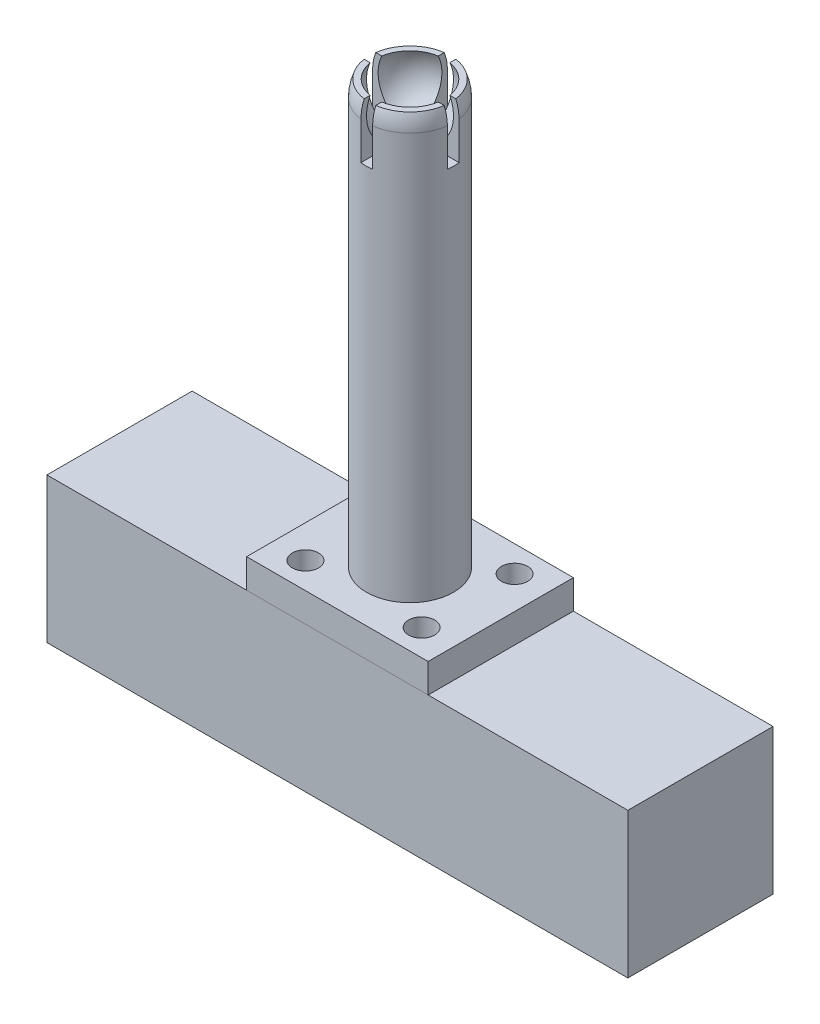
ISO-10303-21;
HEADER;
FILE_DESCRIPTION(('STEP AP214'),'2;1');
FILE_NAME('part.step','',(''),(''),'','','');
FILE_SCHEMA(('AUTOMOTIVE_DESIGN { 1 0 10303 214 1 1 1 1 }'));
ENDSEC;
DATA;
#1=APPLICATION_CONTEXT('core data for automotive mechanical design processes');
#2=APPLICATION_PROTOCOL_DEFINITION('international standard','automotive_design',2000,#1);
#3=PRODUCT_CONTEXT('',#1,'mechanical');
#4=PRODUCT('Part','Part','',(#3));
#5=PRODUCT_RELATED_PRODUCT_CATEGORY('part','',(#4));
#6=PRODUCT_DEFINITION_FORMATION('','',#4);
#7=PRODUCT_DEFINITION_CONTEXT('part definition',#1,'design');
#8=PRODUCT_DEFINITION('design','',#6,#7);
#9=PRODUCT_DEFINITION_SHAPE('','',#8);
#10=(LENGTH_UNIT() NAMED_UNIT(*) SI_UNIT(.MILLI.,.METRE.));
#11=(NAMED_UNIT(*) PLANE_ANGLE_UNIT() SI_UNIT($,.RADIAN.));
#12=(NAMED_UNIT(*) SI_UNIT($,.STERADIAN.) SOLID_ANGLE_UNIT());
#13=UNCERTAINTY_MEASURE_WITH_UNIT(LENGTH_MEASURE(1.E-05),#10,'distance_accuracy_value','');
#14=(GEOMETRIC_REPRESENTATION_CONTEXT(3) GLOBAL_UNCERTAINTY_ASSIGNED_CONTEXT((#13)) GLOBAL_UNIT_ASSIGNED_CONTEXT((#10,
#11,#12)) REPRESENTATION_CONTEXT('',''));
#15=CARTESIAN_POINT('',(0.,0.,0.));
#16=DIRECTION('',(0.,0.,1.));
#17=DIRECTION('',(1.,0.,0.));
#18=AXIS2_PLACEMENT_3D('',#15,#16,#17);
#19=CARTESIAN_POINT('',(0.,93.98,0.));
#20=DIRECTION('',(0.,-1.,0.));
#21=DIRECTION('',(0.,0.,-1.));
#22=AXIS2_PLACEMENT_3D('',#19,#20,#21);
#23=CYLINDRICAL_SURFACE('',#22,7.62);
#24=CARTESIAN_POINT('',(0.,30.48,0.));
#25=DIRECTION('',(0.,1.,0.));
#26=DIRECTION('',(0.,0.,1.));
#27=AXIS2_PLACEMENT_3D('',#24,#25,#26);
#28=CIRCLE('',#27,7.62);
#29=CARTESIAN_POINT('',(0.,30.48,7.62));
#30=VERTEX_POINT('',#29);
#31=EDGE_CURVE('E346',#30,#30,#28,.T.);
#32=ORIENTED_EDGE('',*,*,#31,.T.);
#33=EDGE_LOOP('',(#32));
#34=FACE_BOUND('',#33,.T.);
#35=CARTESIAN_POINT('',(0.,101.6,0.));
#36=DIRECTION('',(0.,1.,0.));
#37=DIRECTION('',(0.,0.,1.));
#38=AXIS2_PLACEMENT_3D('',#35,#36,#37);
#39=CIRCLE('',#38,7.62);
#40=CARTESIAN_POINT('',(7.5519629236378,101.6,-1.016));
#41=VERTEX_POINT('',#40);
#42=CARTESIAN_POINT('',(1.016,101.6,-7.5519629236378));
#43=VERTEX_POINT('',#42);
#44=EDGE_CURVE('E336',#41,#43,#39,.T.);
#45=ORIENTED_EDGE('',*,*,#44,.F.);
#46=DIRECTION('',(0.,-1.,0.));
#47=VECTOR('',#46,1.);
#48=CARTESIAN_POINT('',(7.5519629236378,93.98,-1.016));
#49=LINE('',#48,#47);
#50=CARTESIAN_POINT('',(7.5519629236378,95.0198072601561,-1.016));
#51=VERTEX_POINT('',#50);
#52=EDGE_CURVE('E294',#41,#51,#49,.T.);
#53=ORIENTED_EDGE('',*,*,#52,.T.);
#54=CARTESIAN_POINT('',(0.,95.0198072601561,0.));
#55=DIRECTION('',(0.,1.,0.));
#56=DIRECTION('',(0.,0.,1.));
#57=AXIS2_PLACEMENT_3D('',#54,#55,#56);
#58=CIRCLE('',#57,7.62);
#59=CARTESIAN_POINT('',(7.5519629236378,95.0198072601561,1.016));
#60=VERTEX_POINT('',#59);
#61=EDGE_CURVE('E331',#60,#51,#58,.T.);
#62=ORIENTED_EDGE('',*,*,#61,.F.);
#63=DIRECTION('',(0.,-1.,0.));
#64=VECTOR('',#63,1.);
#65=CARTESIAN_POINT('',(7.5519629236378,93.98,1.016));
#66=LINE('',#65,#64);
#67=CARTESIAN_POINT('',(7.5519629236378,101.6,1.016));
#68=VERTEX_POINT('',#67);
#69=EDGE_CURVE('E230',#68,#60,#66,.T.);
#70=ORIENTED_EDGE('',*,*,#69,.F.);
#71=CARTESIAN_POINT('',(1.01600000000001,101.6,7.5519629236378));
#72=VERTEX_POINT('',#71);
#73=EDGE_CURVE('E332',#72,#68,#39,.T.);
#74=ORIENTED_EDGE('',*,*,#73,.F.);
#75=DIRECTION('',(0.,-1.,0.));
#76=VECTOR('',#75,1.);
#77=CARTESIAN_POINT('',(1.01600000000001,93.98,7.5519629236378));
#78=LINE('',#77,#76);
#79=CARTESIAN_POINT('',(1.01600000000001,95.0198072601561,7.5519629236378));
#80=VERTEX_POINT('',#79);
#81=EDGE_CURVE('E326',#80,#72,#78,.F.);
#82=ORIENTED_EDGE('',*,*,#81,.F.);
#83=CARTESIAN_POINT('',(-1.01599999999999,95.0198072601561,7.5519629236378));
#84=VERTEX_POINT('',#83);
#85=EDGE_CURVE('E249',#84,#80,#58,.T.);
#86=ORIENTED_EDGE('',*,*,#85,.F.);
#87=DIRECTION('',(0.,-1.,0.));
#88=VECTOR('',#87,1.);
#89=CARTESIAN_POINT('',(-1.01599999999999,93.98,7.5519629236378));
#90=LINE('',#89,#88);
#91=CARTESIAN_POINT('',(-1.01599999999999,101.6,7.5519629236378));
#92=VERTEX_POINT('',#91);
#93=EDGE_CURVE('E320',#84,#92,#90,.F.);
#94=ORIENTED_EDGE('',*,*,#93,.T.);
#95=CARTESIAN_POINT('',(-7.5519629236378,101.6,1.016));
#96=VERTEX_POINT('',#95);
#97=EDGE_CURVE('E337',#96,#92,#39,.T.);
#98=ORIENTED_EDGE('',*,*,#97,.F.);
#99=DIRECTION('',(0.,-1.,0.));
#100=VECTOR('',#99,1.);
#101=CARTESIAN_POINT('',(-7.5519629236378,93.98,1.016));
#102=LINE('',#101,#100);
#103=CARTESIAN_POINT('',(-7.5519629236378,95.0198072601561,1.016));
#104=VERTEX_POINT('',#103);
#105=EDGE_CURVE('E316',#104,#96,#102,.F.);
#106=ORIENTED_EDGE('',*,*,#105,.F.);
#107=CARTESIAN_POINT('',(-7.5519629236378,95.0198072601561,-1.016));
#108=VERTEX_POINT('',#107);
#109=EDGE_CURVE('E330',#108,#104,#58,.T.);
#110=ORIENTED_EDGE('',*,*,#109,.F.);
#111=DIRECTION('',(0.,-1.,0.));
#112=VECTOR('',#111,1.);
#113=CARTESIAN_POINT('',(-7.5519629236378,93.98,-1.016));
#114=LINE('',#113,#112);
#115=CARTESIAN_POINT('',(-7.5519629236378,101.6,-1.016));
#116=VERTEX_POINT('',#115);
#117=EDGE_CURVE('E310',#108,#116,#114,.F.);
#118=ORIENTED_EDGE('',*,*,#117,.T.);
#119=CARTESIAN_POINT('',(-1.016,101.6,-7.5519629236378));
#120=VERTEX_POINT('',#119);
#121=EDGE_CURVE('E425',#120,#116,#39,.T.);
#122=ORIENTED_EDGE('',*,*,#121,.F.);
#123=DIRECTION('',(0.,-1.,0.));
#124=VECTOR('',#123,1.);
#125=CARTESIAN_POINT('',(-1.016,93.98,-7.5519629236378));
#126=LINE('',#125,#124);
#127=CARTESIAN_POINT('',(-1.016,95.0198072601561,-7.5519629236378));
#128=VERTEX_POINT('',#127);
#129=EDGE_CURVE('E304',#120,#128,#126,.T.);
#130=ORIENTED_EDGE('',*,*,#129,.T.);
#131=CARTESIAN_POINT('',(1.016,95.0198072601561,-7.5519629236378));
#132=VERTEX_POINT('',#131);
#133=EDGE_CURVE('E427',#132,#128,#58,.T.);
#134=ORIENTED_EDGE('',*,*,#133,.F.);
#135=DIRECTION('',(0.,-1.,0.));
#136=VECTOR('',#135,1.);
#137=CARTESIAN_POINT('',(1.016,93.98,-7.5519629236378));
#138=LINE('',#137,#136);
#139=EDGE_CURVE('E300',#43,#132,#138,.T.);
#140=ORIENTED_EDGE('',*,*,#139,.F.);
#141=EDGE_LOOP('',(#45,#53,#62,#70,#74,#82,#86,#94,#98,#106,#110,#118,#122,#130,#134,#140));
#142=FACE_BOUND('',#141,.T.);
#143=ADVANCED_FACE('F53',(#34,#142),#23,.T.);
#144=CARTESIAN_POINT('',(0.,101.6,0.));
#145=DIRECTION('',(0.,1.,0.));
#146=DIRECTION('',(-1.,0.,0.));
#147=AXIS2_PLACEMENT_3D('',#144,#145,#146);
#148=SPHERICAL_SURFACE('',#147,6.6675);
#149=CARTESIAN_POINT('',(0.,104.417807260156,0.));
#150=DIRECTION('',(0.,1.,0.));
#151=DIRECTION('',(0.,0.,1.));
#152=AXIS2_PLACEMENT_3D('',#149,#150,#151);
#153=CIRCLE('',#152,6.04280717006687);
#154=CARTESIAN_POINT('',(-5.95678289805929,104.417807260156,1.016));
#155=VERTEX_POINT('',#154);
#156=CARTESIAN_POINT('',(-1.01599999999999,104.417807260156,5.95678289805929));
#157=VERTEX_POINT('',#156);
#158=EDGE_CURVE('E341',#155,#157,#153,.T.);
#159=ORIENTED_EDGE('',*,*,#158,.T.);
#160=CARTESIAN_POINT('',(-1.01599999999999,101.6,0.));
#161=DIRECTION('',(-1.,0.,0.));
#162=DIRECTION('',(0.,0.,1.));
#163=AXIS2_PLACEMENT_3D('',#160,#161,#162);
#164=CIRCLE('',#163,6.58963582074154);
#165=CARTESIAN_POINT('',(-1.01599999999999,95.0891594820638,1.016));
#166=VERTEX_POINT('',#165);
#167=EDGE_CURVE('E323',#157,#166,#164,.F.);
#168=ORIENTED_EDGE('',*,*,#167,.T.);
#169=CARTESIAN_POINT('',(0.,101.6,1.016));
#170=DIRECTION('',(0.,0.,-1.));
#171=DIRECTION('',(-1.,0.,0.));
#172=AXIS2_PLACEMENT_3D('',#169,#170,#171);
#173=CIRCLE('',#172,6.58963582074154);
#174=EDGE_CURVE('E318',#155,#166,#173,.F.);
#175=ORIENTED_EDGE('',*,*,#174,.F.);
#176=EDGE_LOOP('',(#159,#168,#175));
#177=FACE_BOUND('',#176,.T.);
#178=ADVANCED_FACE('F440',(#177),#148,.F.);
#179=CARTESIAN_POINT('',(1.01600000000001,101.6,0.));
#180=DIRECTION('',(-1.,0.,0.));
#181=DIRECTION('',(0.,0.,1.));
#182=AXIS2_PLACEMENT_3D('',#179,#180,#181);
#183=CIRCLE('',#182,6.58963582074154);
#184=CARTESIAN_POINT('',(1.01600000000001,95.0891594820638,-1.016));
#185=VERTEX_POINT('',#184);
#186=CARTESIAN_POINT('',(1.016,104.417807260156,-5.95678289805929));
#187=VERTEX_POINT('',#186);
#188=EDGE_CURVE('E302',#185,#187,#183,.F.);
#189=ORIENTED_EDGE('',*,*,#188,.F.);
#190=CARTESIAN_POINT('',(0.,101.6,-1.016));
#191=DIRECTION('',(0.,0.,-1.));
#192=DIRECTION('',(-1.,0.,0.));
#193=AXIS2_PLACEMENT_3D('',#190,#191,#192);
#194=CIRCLE('',#193,6.58963582074154);
#195=CARTESIAN_POINT('',(5.95678289805929,104.417807260156,-1.016));
#196=VERTEX_POINT('',#195);
#197=EDGE_CURVE('E297',#185,#196,#194,.F.);
#198=ORIENTED_EDGE('',*,*,#197,.T.);
#199=EDGE_CURVE('E347',#196,#187,#153,.T.);
#200=ORIENTED_EDGE('',*,*,#199,.T.);
#201=EDGE_LOOP('',(#189,#198,#200));
#202=FACE_BOUND('',#201,.T.);
#203=ADVANCED_FACE('F451',(#202),#148,.F.);
#204=CARTESIAN_POINT('',(1.01600000000001,101.6,0.));
#205=DIRECTION('',(-1.,0.,0.));
#206=DIRECTION('',(0.,0.,1.));
#207=AXIS2_PLACEMENT_3D('',#204,#205,#206);
#208=CIRCLE('',#207,6.58963582074154);
#209=CARTESIAN_POINT('',(1.01600000000001,104.417807260156,5.95678289805929));
#210=VERTEX_POINT('',#209);
#211=CARTESIAN_POINT('',(1.01600000000001,95.0891594820638,1.016));
#212=VERTEX_POINT('',#211);
#213=EDGE_CURVE('E242',#210,#212,#208,.F.);
#214=ORIENTED_EDGE('',*,*,#213,.F.);
#215=CARTESIAN_POINT('',(5.95678289805929,104.417807260156,1.016));
#216=VERTEX_POINT('',#215);
#217=EDGE_CURVE('E343',#210,#216,#153,.T.);
#218=ORIENTED_EDGE('',*,*,#217,.T.);
#219=CARTESIAN_POINT('',(0.,101.6,1.016));
#220=DIRECTION('',(0.,0.,-1.));
#221=DIRECTION('',(-1.,0.,0.));
#222=AXIS2_PLACEMENT_3D('',#219,#220,#221);
#223=CIRCLE('',#222,6.58963582074154);
#224=EDGE_CURVE('E292',#212,#216,#223,.F.);
#225=ORIENTED_EDGE('',*,*,#224,.F.);
#226=EDGE_LOOP('',(#214,#218,#225));
#227=FACE_BOUND('',#226,.T.);
#228=ADVANCED_FACE('F595',(#227),#148,.F.);
#229=CARTESIAN_POINT('',(-2.79463802660951E-12,104.417807260156,0.));
#230=DIRECTION('',(0.,1.,0.));
#231=DIRECTION('',(0.,0.,1.));
#232=AXIS2_PLACEMENT_3D('',#229,#230,#231);
#233=PLANE('',#232);
#234=ORIENTED_EDGE('',*,*,#217,.F.);
#235=DIRECTION('',(0.,0.,1.));
#236=VECTOR('',#235,1.);
#237=CARTESIAN_POINT('',(1.01600000000001,104.417807260156,0.));
#238=LINE('',#237,#236);
#239=CARTESIAN_POINT('',(1.01600000000001,104.417807260156,7.0065759286981));
#240=VERTEX_POINT('',#239);
#241=EDGE_CURVE('E268',#210,#240,#238,.T.);
#242=ORIENTED_EDGE('',*,*,#241,.T.);
#243=CARTESIAN_POINT('',(0.,104.417807260156,0.));
#244=DIRECTION('',(0.,1.,0.));
#245=DIRECTION('',(0.,0.,1.));
#246=AXIS2_PLACEMENT_3D('',#243,#244,#245);
#247=CIRCLE('',#246,7.07985608925858);
#248=CARTESIAN_POINT('',(7.00657592869811,104.417807260156,1.016));
#249=VERTEX_POINT('',#248);
#250=EDGE_CURVE('E338',#240,#249,#247,.T.);
#251=ORIENTED_EDGE('',*,*,#250,.T.);
#252=DIRECTION('',(-1.,0.,0.));
#253=VECTOR('',#252,1.);
#254=CARTESIAN_POINT('',(0.,104.417807260156,1.016));
#255=LINE('',#254,#253);
#256=EDGE_CURVE('E69',#249,#216,#255,.T.);
#257=ORIENTED_EDGE('',*,*,#256,.T.);
#258=EDGE_LOOP('',(#234,#242,#251,#257));
#259=FACE_BOUND('',#258,.T.);
#260=ADVANCED_FACE('F589',(#259),#233,.T.);
#261=DIRECTION('',(0.,0.,1.));
#262=VECTOR('',#261,1.);
#263=CARTESIAN_POINT('',(-1.01599999999999,104.417807260156,0.));
#264=LINE('',#263,#262);
#265=CARTESIAN_POINT('',(-1.01599999999999,104.417807260156,7.0065759286981));
#266=VERTEX_POINT('',#265);
#267=EDGE_CURVE('E250',#157,#266,#264,.T.);
#268=ORIENTED_EDGE('',*,*,#267,.F.);
#269=ORIENTED_EDGE('',*,*,#158,.F.);
#270=DIRECTION('',(-1.,0.,0.));
#271=VECTOR('',#270,1.);
#272=CARTESIAN_POINT('',(0.,104.417807260156,1.016));
#273=LINE('',#272,#271);
#274=CARTESIAN_POINT('',(-7.0065759286981,104.417807260156,1.016));
#275=VERTEX_POINT('',#274);
#276=EDGE_CURVE('E252',#155,#275,#273,.T.);
#277=ORIENTED_EDGE('',*,*,#276,.T.);
#278=EDGE_CURVE('E335',#275,#266,#247,.T.);
#279=ORIENTED_EDGE('',*,*,#278,.T.);
#280=EDGE_LOOP('',(#268,#269,#277,#279));
#281=FACE_BOUND('',#280,.T.);
#282=ADVANCED_FACE('F582',(#281),#233,.T.);
#283=CARTESIAN_POINT('',(7.0065759286981,104.417807260156,-1.016));
#284=VERTEX_POINT('',#283);
#285=CARTESIAN_POINT('',(1.016,104.417807260156,-7.0065759286981));
#286=VERTEX_POINT('',#285);
#287=EDGE_CURVE('E342',#284,#286,#247,.T.);
#288=ORIENTED_EDGE('',*,*,#287,.T.);
#289=DIRECTION('',(0.,0.,1.));
#290=VECTOR('',#289,1.);
#291=CARTESIAN_POINT('',(1.01600000000001,104.417807260156,0.));
#292=LINE('',#291,#290);
#293=EDGE_CURVE('E274',#286,#187,#292,.T.);
#294=ORIENTED_EDGE('',*,*,#293,.T.);
#295=ORIENTED_EDGE('',*,*,#199,.F.);
#296=DIRECTION('',(-1.,0.,0.));
#297=VECTOR('',#296,1.);
#298=CARTESIAN_POINT('',(0.,104.417807260156,-1.016));
#299=LINE('',#298,#297);
#300=EDGE_CURVE('E272',#284,#196,#299,.T.);
#301=ORIENTED_EDGE('',*,*,#300,.F.);
#302=EDGE_LOOP('',(#288,#294,#295,#301));
#303=FACE_BOUND('',#302,.T.);
#304=ADVANCED_FACE('F455',(#303),#233,.T.);
#305=CARTESIAN_POINT('',(0.,101.6,0.));
#306=DIRECTION('',(0.,1.,0.));
#307=DIRECTION('',(-1.,0.,0.));
#308=AXIS2_PLACEMENT_3D('',#305,#306,#307);
#309=SPHERICAL_SURFACE('',#308,7.62);
#310=ORIENTED_EDGE('',*,*,#250,.F.);
#311=CARTESIAN_POINT('',(1.01600000000001,101.6,0.));
#312=DIRECTION('',(-1.,0.,0.));
#313=DIRECTION('',(0.,0.,1.));
#314=AXIS2_PLACEMENT_3D('',#311,#312,#313);
#315=CIRCLE('',#314,7.5519629236378);
#316=EDGE_CURVE('E12',#240,#72,#315,.F.);
#317=ORIENTED_EDGE('',*,*,#316,.T.);
#318=ORIENTED_EDGE('',*,*,#73,.T.);
#319=CARTESIAN_POINT('',(0.,101.6,1.016));
#320=DIRECTION('',(0.,0.,-1.));
#321=DIRECTION('',(-1.,0.,0.));
#322=AXIS2_PLACEMENT_3D('',#319,#320,#321);
#323=CIRCLE('',#322,7.5519629236378);
#324=EDGE_CURVE('E397',#68,#249,#323,.F.);
#325=ORIENTED_EDGE('',*,*,#324,.T.);
#326=EDGE_LOOP('',(#310,#317,#318,#325));
#327=FACE_BOUND('',#326,.T.);
#328=ADVANCED_FACE('F570',(#327),#309,.T.);
#329=CARTESIAN_POINT('',(-1.01599999999999,101.6,0.));
#330=DIRECTION('',(-1.,0.,0.));
#331=DIRECTION('',(0.,0.,1.));
#332=AXIS2_PLACEMENT_3D('',#329,#330,#331);
#333=CIRCLE('',#332,7.5519629236378);
#334=EDGE_CURVE('E62',#266,#92,#333,.F.);
#335=ORIENTED_EDGE('',*,*,#334,.F.);
#336=ORIENTED_EDGE('',*,*,#278,.F.);
#337=CARTESIAN_POINT('',(0.,101.6,1.016));
#338=DIRECTION('',(0.,0.,-1.));
#339=DIRECTION('',(-1.,0.,0.));
#340=AXIS2_PLACEMENT_3D('',#337,#338,#339);
#341=CIRCLE('',#340,7.5519629236378);
#342=EDGE_CURVE('E408',#275,#96,#341,.F.);
#343=ORIENTED_EDGE('',*,*,#342,.T.);
#344=ORIENTED_EDGE('',*,*,#97,.T.);
#345=EDGE_LOOP('',(#335,#336,#343,#344));
#346=FACE_BOUND('',#345,.T.);
#347=ADVANCED_FACE('F424',(#346),#309,.T.);
#348=ORIENTED_EDGE('',*,*,#44,.T.);
#349=CARTESIAN_POINT('',(1.01600000000001,101.6,0.));
#350=DIRECTION('',(-1.,0.,0.));
#351=DIRECTION('',(0.,0.,1.));
#352=AXIS2_PLACEMENT_3D('',#349,#350,#351);
#353=CIRCLE('',#352,7.5519629236378);
#354=EDGE_CURVE('E401',#43,#286,#353,.F.);
#355=ORIENTED_EDGE('',*,*,#354,.T.);
#356=ORIENTED_EDGE('',*,*,#287,.F.);
#357=CARTESIAN_POINT('',(0.,101.6,-1.016));
#358=DIRECTION('',(0.,0.,-1.));
#359=DIRECTION('',(-1.,0.,0.));
#360=AXIS2_PLACEMENT_3D('',#357,#358,#359);
#361=CIRCLE('',#360,7.5519629236378);
#362=EDGE_CURVE('E399',#41,#284,#361,.F.);
#363=ORIENTED_EDGE('',*,*,#362,.F.);
#364=EDGE_LOOP('',(#348,#355,#356,#363));
#365=FACE_BOUND('',#364,.T.);
#366=ADVANCED_FACE('F462',(#365),#309,.T.);
#367=CARTESIAN_POINT('',(0.,30.48,0.));
#368=DIRECTION('',(0.,1.,0.));
#369=DIRECTION('',(0.,0.,1.));
#370=AXIS2_PLACEMENT_3D('',#367,#368,#369);
#371=PLANE('',#370);
#372=ORIENTED_EDGE('',*,*,#31,.F.);
#373=EDGE_LOOP('',(#372));
#374=FACE_BOUND('',#373,.T.);
#375=CARTESIAN_POINT('',(-10.16,30.48,-8.12800000000001));
#376=DIRECTION('',(0.,1.,0.));
#377=DIRECTION('',(0.,0.,1.));
#378=AXIS2_PLACEMENT_3D('',#375,#376,#377);
#379=CIRCLE('',#378,2.286);
#380=CARTESIAN_POINT('',(-10.16,30.48,-5.84200000000001));
#381=VERTEX_POINT('',#380);
#382=EDGE_CURVE('E357',#381,#381,#379,.T.);
#383=ORIENTED_EDGE('',*,*,#382,.F.);
#384=EDGE_LOOP('',(#383));
#385=FACE_BOUND('',#384,.T.);
#386=CARTESIAN_POINT('',(10.16,30.48,8.12800000000001));
#387=DIRECTION('',(0.,1.,0.));
#388=DIRECTION('',(0.,0.,1.));
#389=AXIS2_PLACEMENT_3D('',#386,#387,#388);
#390=CIRCLE('',#389,2.286);
#391=CARTESIAN_POINT('',(10.16,30.48,10.414));
#392=VERTEX_POINT('',#391);
#393=EDGE_CURVE('E369',#392,#392,#390,.T.);
#394=ORIENTED_EDGE('',*,*,#393,.F.);
#395=EDGE_LOOP('',(#394));
#396=FACE_BOUND('',#395,.T.);
#397=DIRECTION('',(0.,0.,-1.));
#398=VECTOR('',#397,1.);
#399=CARTESIAN_POINT('',(15.875,30.48,-12.7));
#400=LINE('',#399,#398);
#401=CARTESIAN_POINT('',(15.875,30.48,12.7));
#402=VERTEX_POINT('',#401);
#403=CARTESIAN_POINT('',(15.875,30.48,-12.7));
#404=VERTEX_POINT('',#403);
#405=EDGE_CURVE('E375',#402,#404,#400,.T.);
#406=ORIENTED_EDGE('',*,*,#405,.T.);
#407=DIRECTION('',(-1.,0.,0.));
#408=VECTOR('',#407,1.);
#409=CARTESIAN_POINT('',(-15.875,30.48,-12.7));
#410=LINE('',#409,#408);
#411=CARTESIAN_POINT('',(-15.875,30.48,-12.7));
#412=VERTEX_POINT('',#411);
#413=EDGE_CURVE('E107',#404,#412,#410,.T.);
#414=ORIENTED_EDGE('',*,*,#413,.T.);
#415=DIRECTION('',(0.,0.,1.));
#416=VECTOR('',#415,1.);
#417=CARTESIAN_POINT('',(-15.875,30.48,-12.7));
#418=LINE('',#417,#416);
#419=CARTESIAN_POINT('',(-15.875,30.48,12.7));
#420=VERTEX_POINT('',#419);
#421=EDGE_CURVE('E378',#412,#420,#418,.T.);
#422=ORIENTED_EDGE('',*,*,#421,.T.);
#423=DIRECTION('',(1.,0.,0.));
#424=VECTOR('',#423,1.);
#425=CARTESIAN_POINT('',(-15.875,30.48,12.7));
#426=LINE('',#425,#424);
#427=EDGE_CURVE('E78',#420,#402,#426,.T.);
#428=ORIENTED_EDGE('',*,*,#427,.T.);
#429=EDGE_LOOP('',(#406,#414,#422,#428));
#430=FACE_BOUND('',#429,.T.);
#431=CARTESIAN_POINT('',(-10.16,30.48,8.12800000000001));
#432=DIRECTION('',(0.,1.,0.));
#433=DIRECTION('',(0.,0.,1.));
#434=AXIS2_PLACEMENT_3D('',#431,#432,#433);
#435=CIRCLE('',#434,2.286);
#436=CARTESIAN_POINT('',(-10.16,30.48,10.414));
#437=VERTEX_POINT('',#436);
#438=EDGE_CURVE('E363',#437,#437,#435,.T.);
#439=ORIENTED_EDGE('',*,*,#438,.F.);
#440=EDGE_LOOP('',(#439));
#441=FACE_BOUND('',#440,.T.);
#442=CARTESIAN_POINT('',(10.16,30.48,-8.12800000000001));
#443=DIRECTION('',(0.,1.,0.));
#444=DIRECTION('',(0.,0.,1.));
#445=AXIS2_PLACEMENT_3D('',#442,#443,#444);
#446=CIRCLE('',#445,2.286);
#447=CARTESIAN_POINT('',(10.16,30.48,-5.84200000000001));
#448=VERTEX_POINT('',#447);
#449=EDGE_CURVE('E351',#448,#448,#446,.T.);
#450=ORIENTED_EDGE('',*,*,#449,.F.);
#451=EDGE_LOOP('',(#450));
#452=FACE_BOUND('',#451,.T.);
#453=ADVANCED_FACE('F504',(#374,#385,#396,#430,#441,#452),#371,.T.);
#454=CARTESIAN_POINT('',(0.,25.4,0.));
#455=DIRECTION('',(0.,1.,0.));
#456=DIRECTION('',(0.,0.,1.));
#457=AXIS2_PLACEMENT_3D('',#454,#455,#456);
#458=PLANE('',#457);
#459=DIRECTION('',(0.,0.,-1.));
#460=VECTOR('',#459,1.);
#461=CARTESIAN_POINT('',(15.875,25.4,-12.7));
#462=LINE('',#461,#460);
#463=CARTESIAN_POINT('',(15.875,25.4,12.7));
#464=VERTEX_POINT('',#463);
#465=CARTESIAN_POINT('',(15.875,25.4,-12.7));
#466=VERTEX_POINT('',#465);
#467=EDGE_CURVE('E372',#464,#466,#462,.T.);
#468=ORIENTED_EDGE('',*,*,#467,.F.);
#469=DIRECTION('',(1.,0.,0.));
#470=VECTOR('',#469,1.);
#471=CARTESIAN_POINT('',(-15.875,25.4,12.7));
#472=LINE('',#471,#470);
#473=CARTESIAN_POINT('',(-15.875,25.4,12.7));
#474=VERTEX_POINT('',#473);
#475=EDGE_CURVE('E99',#474,#464,#472,.T.);
#476=ORIENTED_EDGE('',*,*,#475,.F.);
#477=DIRECTION('',(0.,0.,1.));
#478=VECTOR('',#477,1.);
#479=CARTESIAN_POINT('',(-15.875,25.4,-12.7));
#480=LINE('',#479,#478);
#481=CARTESIAN_POINT('',(-15.875,25.4,-12.7));
#482=VERTEX_POINT('',#481);
#483=EDGE_CURVE('E386',#482,#474,#480,.T.);
#484=ORIENTED_EDGE('',*,*,#483,.F.);
#485=DIRECTION('',(-1.,0.,0.));
#486=VECTOR('',#485,1.);
#487=CARTESIAN_POINT('',(-15.875,25.4,-12.7));
#488=LINE('',#487,#486);
#489=EDGE_CURVE('E384',#466,#482,#488,.T.);
#490=ORIENTED_EDGE('',*,*,#489,.F.);
#491=EDGE_LOOP('',(#468,#476,#484,#490));
#492=FACE_BOUND('',#491,.T.);
#493=CARTESIAN_POINT('',(10.16,25.4,8.12800000000001));
#494=DIRECTION('',(0.,1.,0.));
#495=DIRECTION('',(0.,0.,1.));
#496=AXIS2_PLACEMENT_3D('',#493,#494,#495);
#497=CIRCLE('',#496,2.286);
#498=CARTESIAN_POINT('',(10.16,25.4,10.414));
#499=VERTEX_POINT('',#498);
#500=EDGE_CURVE('E366',#499,#499,#497,.T.);
#501=ORIENTED_EDGE('',*,*,#500,.T.);
#502=EDGE_LOOP('',(#501));
#503=FACE_BOUND('',#502,.T.);
#504=CARTESIAN_POINT('',(-10.16,25.4,8.12800000000001));
#505=DIRECTION('',(0.,1.,0.));
#506=DIRECTION('',(0.,0.,1.));
#507=AXIS2_PLACEMENT_3D('',#504,#505,#506);
#508=CIRCLE('',#507,2.286);
#509=CARTESIAN_POINT('',(-10.16,25.4,10.414));
#510=VERTEX_POINT('',#509);
#511=EDGE_CURVE('E360',#510,#510,#508,.T.);
#512=ORIENTED_EDGE('',*,*,#511,.T.);
#513=EDGE_LOOP('',(#512));
#514=FACE_BOUND('',#513,.T.);
#515=CARTESIAN_POINT('',(-10.16,25.4,-8.12800000000001));
#516=DIRECTION('',(0.,1.,0.));
#517=DIRECTION('',(0.,0.,1.));
#518=AXIS2_PLACEMENT_3D('',#515,#516,#517);
#519=CIRCLE('',#518,2.286);
#520=CARTESIAN_POINT('',(-10.16,25.4,-5.84200000000001));
#521=VERTEX_POINT('',#520);
#522=EDGE_CURVE('E354',#521,#521,#519,.T.);
#523=ORIENTED_EDGE('',*,*,#522,.T.);
#524=EDGE_LOOP('',(#523));
#525=FACE_BOUND('',#524,.T.);
#526=CARTESIAN_POINT('',(10.16,25.4,-8.12800000000001));
#527=DIRECTION('',(0.,1.,0.));
#528=DIRECTION('',(0.,0.,1.));
#529=AXIS2_PLACEMENT_3D('',#526,#527,#528);
#530=CIRCLE('',#529,2.286);
#531=CARTESIAN_POINT('',(10.16,25.4,-5.84200000000001));
#532=VERTEX_POINT('',#531);
#533=EDGE_CURVE('E350',#532,#532,#530,.T.);
#534=ORIENTED_EDGE('',*,*,#533,.T.);
#535=EDGE_LOOP('',(#534));
#536=FACE_BOUND('',#535,.T.);
#537=ADVANCED_FACE('F507',(#492,#503,#514,#525,#536),#458,.F.);
#538=CARTESIAN_POINT('',(15.875,30.48,-12.7));
#539=DIRECTION('',(-1.,0.,0.));
#540=DIRECTION('',(0.,0.,1.));
#541=AXIS2_PLACEMENT_3D('',#538,#539,#540);
#542=PLANE('',#541);
#543=ORIENTED_EDGE('',*,*,#467,.T.);
#544=DIRECTION('',(0.,-1.,0.));
#545=VECTOR('',#544,1.);
#546=CARTESIAN_POINT('',(15.875,30.48,-12.7));
#547=LINE('',#546,#545);
#548=EDGE_CURVE('E395',#404,#466,#547,.T.);
#549=ORIENTED_EDGE('',*,*,#548,.F.);
#550=ORIENTED_EDGE('',*,*,#405,.F.);
#551=DIRECTION('',(0.,-1.,0.));
#552=VECTOR('',#551,1.);
#553=CARTESIAN_POINT('',(15.875,30.48,12.7));
#554=LINE('',#553,#552);
#555=EDGE_CURVE('E381',#402,#464,#554,.T.);
#556=ORIENTED_EDGE('',*,*,#555,.T.);
#557=EDGE_LOOP('',(#543,#549,#550,#556));
#558=FACE_BOUND('',#557,.T.);
#559=ADVANCED_FACE('F55',(#558),#542,.F.);
#560=CARTESIAN_POINT('',(-15.875,30.48,-12.7));
#561=DIRECTION('',(0.,0.,1.));
#562=DIRECTION('',(1.,0.,0.));
#563=AXIS2_PLACEMENT_3D('',#560,#561,#562);
#564=PLANE('',#563);
#565=ORIENTED_EDGE('',*,*,#489,.T.);
#566=DIRECTION('',(0.,-1.,0.));
#567=VECTOR('',#566,1.);
#568=CARTESIAN_POINT('',(-15.875,30.48,-12.7));
#569=LINE('',#568,#567);
#570=EDGE_CURVE('E392',#412,#482,#569,.T.);
#571=ORIENTED_EDGE('',*,*,#570,.F.);
#572=ORIENTED_EDGE('',*,*,#413,.F.);
#573=ORIENTED_EDGE('',*,*,#548,.T.);
#574=EDGE_LOOP('',(#565,#571,#572,#573));
#575=FACE_BOUND('',#574,.T.);
#576=ADVANCED_FACE('F516',(#575),#564,.F.);
#577=CARTESIAN_POINT('',(-15.875,30.48,-12.7));
#578=DIRECTION('',(1.,0.,0.));
#579=DIRECTION('',(0.,0.,-1.));
#580=AXIS2_PLACEMENT_3D('',#577,#578,#579);
#581=PLANE('',#580);
#582=ORIENTED_EDGE('',*,*,#483,.T.);
#583=DIRECTION('',(0.,-1.,0.));
#584=VECTOR('',#583,1.);
#585=CARTESIAN_POINT('',(-15.875,30.48,12.7));
#586=LINE('',#585,#584);
#587=EDGE_CURVE('E390',#420,#474,#586,.T.);
#588=ORIENTED_EDGE('',*,*,#587,.F.);
#589=ORIENTED_EDGE('',*,*,#421,.F.);
#590=ORIENTED_EDGE('',*,*,#570,.T.);
#591=EDGE_LOOP('',(#582,#588,#589,#590));
#592=FACE_BOUND('',#591,.T.);
#593=ADVANCED_FACE('F514',(#592),#581,.F.);
#594=CARTESIAN_POINT('',(-15.875,30.48,12.7));
#595=DIRECTION('',(0.,0.,-1.));
#596=DIRECTION('',(-1.,0.,0.));
#597=AXIS2_PLACEMENT_3D('',#594,#595,#596);
#598=PLANE('',#597);
#599=ORIENTED_EDGE('',*,*,#475,.T.);
#600=ORIENTED_EDGE('',*,*,#555,.F.);
#601=ORIENTED_EDGE('',*,*,#427,.F.);
#602=ORIENTED_EDGE('',*,*,#587,.T.);
#603=EDGE_LOOP('',(#599,#600,#601,#602));
#604=FACE_BOUND('',#603,.T.);
#605=ADVANCED_FACE('F502',(#604),#598,.F.);
#606=CARTESIAN_POINT('',(10.16,30.48,8.12800000000001));
#607=DIRECTION('',(0.,-1.,0.));
#608=DIRECTION('',(0.,0.,-1.));
#609=AXIS2_PLACEMENT_3D('',#606,#607,#608);
#610=CYLINDRICAL_SURFACE('',#609,2.286);
#611=ORIENTED_EDGE('',*,*,#393,.T.);
#612=EDGE_LOOP('',(#611));
#613=FACE_BOUND('',#612,.T.);
#614=ORIENTED_EDGE('',*,*,#500,.F.);
#615=EDGE_LOOP('',(#614));
#616=FACE_BOUND('',#615,.T.);
#617=ADVANCED_FACE('F498',(#613,#616),#610,.F.);
#618=CARTESIAN_POINT('',(-10.16,30.48,8.12800000000001));
#619=DIRECTION('',(0.,-1.,0.));
#620=DIRECTION('',(0.,0.,-1.));
#621=AXIS2_PLACEMENT_3D('',#618,#619,#620);
#622=CYLINDRICAL_SURFACE('',#621,2.286);
#623=ORIENTED_EDGE('',*,*,#438,.T.);
#624=EDGE_LOOP('',(#623));
#625=FACE_BOUND('',#624,.T.);
#626=ORIENTED_EDGE('',*,*,#511,.F.);
#627=EDGE_LOOP('',(#626));
#628=FACE_BOUND('',#627,.T.);
#629=ADVANCED_FACE('F494',(#625,#628),#622,.F.);
#630=CARTESIAN_POINT('',(-10.16,30.48,-8.12800000000001));
#631=DIRECTION('',(0.,-1.,0.));
#632=DIRECTION('',(0.,0.,-1.));
#633=AXIS2_PLACEMENT_3D('',#630,#631,#632);
#634=CYLINDRICAL_SURFACE('',#633,2.286);
#635=ORIENTED_EDGE('',*,*,#382,.T.);
#636=EDGE_LOOP('',(#635));
#637=FACE_BOUND('',#636,.T.);
#638=ORIENTED_EDGE('',*,*,#522,.F.);
#639=EDGE_LOOP('',(#638));
#640=FACE_BOUND('',#639,.T.);
#641=ADVANCED_FACE('F490',(#637,#640),#634,.F.);
#642=CARTESIAN_POINT('',(10.16,30.48,-8.12800000000001));
#643=DIRECTION('',(0.,-1.,0.));
#644=DIRECTION('',(0.,0.,-1.));
#645=AXIS2_PLACEMENT_3D('',#642,#643,#644);
#646=CYLINDRICAL_SURFACE('',#645,2.286);
#647=ORIENTED_EDGE('',*,*,#449,.T.);
#648=EDGE_LOOP('',(#647));
#649=FACE_BOUND('',#648,.T.);
#650=ORIENTED_EDGE('',*,*,#533,.F.);
#651=EDGE_LOOP('',(#650));
#652=FACE_BOUND('',#651,.T.);
#653=ADVANCED_FACE('F487',(#649,#652),#646,.F.);
#654=CARTESIAN_POINT('',(-1.016,104.417807260156,-5.95678289805929));
#655=VERTEX_POINT('',#654);
#656=CARTESIAN_POINT('',(-5.95678289805929,104.417807260156,-1.016));
#657=VERTEX_POINT('',#656);
#658=EDGE_CURVE('E443',#655,#657,#153,.T.);
#659=ORIENTED_EDGE('',*,*,#658,.T.);
#660=CARTESIAN_POINT('',(0.,101.6,-1.016));
#661=DIRECTION('',(0.,0.,-1.));
#662=DIRECTION('',(-1.,0.,0.));
#663=AXIS2_PLACEMENT_3D('',#660,#661,#662);
#664=CIRCLE('',#663,6.58963582074154);
#665=CARTESIAN_POINT('',(-1.01599999999999,95.0891594820638,-1.016));
#666=VERTEX_POINT('',#665);
#667=EDGE_CURVE('E313',#657,#666,#664,.F.);
#668=ORIENTED_EDGE('',*,*,#667,.T.);
#669=CARTESIAN_POINT('',(-1.01599999999999,101.6,0.));
#670=DIRECTION('',(-1.,0.,0.));
#671=DIRECTION('',(0.,0.,1.));
#672=AXIS2_PLACEMENT_3D('',#669,#670,#671);
#673=CIRCLE('',#672,6.58963582074154);
#674=EDGE_CURVE('E307',#666,#655,#673,.F.);
#675=ORIENTED_EDGE('',*,*,#674,.T.);
#676=EDGE_LOOP('',(#659,#668,#675));
#677=FACE_BOUND('',#676,.T.);
#678=ADVANCED_FACE('F484',(#677),#148,.F.);
#679=DIRECTION('',(-1.,0.,0.));
#680=VECTOR('',#679,1.);
#681=CARTESIAN_POINT('',(0.,104.417807260156,-1.016));
#682=LINE('',#681,#680);
#683=CARTESIAN_POINT('',(-7.0065759286981,104.417807260156,-1.016));
#684=VERTEX_POINT('',#683);
#685=EDGE_CURVE('E279',#657,#684,#682,.T.);
#686=ORIENTED_EDGE('',*,*,#685,.F.);
#687=ORIENTED_EDGE('',*,*,#658,.F.);
#688=DIRECTION('',(0.,0.,1.));
#689=VECTOR('',#688,1.);
#690=CARTESIAN_POINT('',(-1.01599999999999,104.417807260156,0.));
#691=LINE('',#690,#689);
#692=CARTESIAN_POINT('',(-1.016,104.417807260156,-7.0065759286981));
#693=VERTEX_POINT('',#692);
#694=EDGE_CURVE('E277',#693,#655,#691,.T.);
#695=ORIENTED_EDGE('',*,*,#694,.F.);
#696=EDGE_CURVE('E794',#693,#684,#247,.T.);
#697=ORIENTED_EDGE('',*,*,#696,.T.);
#698=EDGE_LOOP('',(#686,#687,#695,#697));
#699=FACE_BOUND('',#698,.T.);
#700=ADVANCED_FACE('F583',(#699),#233,.T.);
#701=CARTESIAN_POINT('',(0.,101.6,-1.016));
#702=DIRECTION('',(0.,0.,-1.));
#703=DIRECTION('',(-1.,0.,0.));
#704=AXIS2_PLACEMENT_3D('',#701,#702,#703);
#705=CIRCLE('',#704,7.5519629236378);
#706=EDGE_CURVE('E406',#684,#116,#705,.F.);
#707=ORIENTED_EDGE('',*,*,#706,.F.);
#708=ORIENTED_EDGE('',*,*,#696,.F.);
#709=CARTESIAN_POINT('',(-1.01599999999999,101.6,0.));
#710=DIRECTION('',(-1.,0.,0.));
#711=DIRECTION('',(0.,0.,1.));
#712=AXIS2_PLACEMENT_3D('',#709,#710,#711);
#713=CIRCLE('',#712,7.5519629236378);
#714=EDGE_CURVE('E404',#120,#693,#713,.F.);
#715=ORIENTED_EDGE('',*,*,#714,.F.);
#716=ORIENTED_EDGE('',*,*,#121,.T.);
#717=EDGE_LOOP('',(#707,#708,#715,#716));
#718=FACE_BOUND('',#717,.T.);
#719=ADVANCED_FACE('F563',(#718),#309,.T.);
#720=CARTESIAN_POINT('',(0.,95.0198072601561,0.));
#721=DIRECTION('',(0.,1.,0.));
#722=DIRECTION('',(0.,0.,1.));
#723=AXIS2_PLACEMENT_3D('',#720,#721,#722);
#724=PLANE('',#723);
#725=CARTESIAN_POINT('',(0.,95.0198072601561,0.));
#726=DIRECTION('',(0.,1.,0.));
#727=DIRECTION('',(0.,0.,1.));
#728=AXIS2_PLACEMENT_3D('',#725,#726,#727);
#729=CIRCLE('',#728,1.07546257791956);
#730=CARTESIAN_POINT('',(0.,95.0198072601561,1.07546257791956));
#731=VERTEX_POINT('',#730);
#732=EDGE_CURVE('E57',#731,#731,#729,.F.);
#733=ORIENTED_EDGE('',*,*,#732,.T.);
#734=EDGE_LOOP('',(#733));
#735=FACE_BOUND('',#734,.T.);
#736=ORIENTED_EDGE('',*,*,#61,.T.);
#737=DIRECTION('',(-1.,0.,0.));
#738=VECTOR('',#737,1.);
#739=CARTESIAN_POINT('',(0.,95.0198072601561,-1.016));
#740=LINE('',#739,#738);
#741=CARTESIAN_POINT('',(1.01600000000001,95.0198072601561,-1.016));
#742=VERTEX_POINT('',#741);
#743=EDGE_CURVE('E234',#51,#742,#740,.T.);
#744=ORIENTED_EDGE('',*,*,#743,.T.);
#745=DIRECTION('',(0.,0.,1.));
#746=VECTOR('',#745,1.);
#747=CARTESIAN_POINT('',(1.01600000000001,95.0198072601561,0.));
#748=LINE('',#747,#746);
#749=EDGE_CURVE('E257',#132,#742,#748,.T.);
#750=ORIENTED_EDGE('',*,*,#749,.F.);
#751=ORIENTED_EDGE('',*,*,#133,.T.);
#752=DIRECTION('',(0.,0.,1.));
#753=VECTOR('',#752,1.);
#754=CARTESIAN_POINT('',(-1.01599999999999,95.0198072601561,0.));
#755=LINE('',#754,#753);
#756=CARTESIAN_POINT('',(-1.01599999999999,95.0198072601561,-1.016));
#757=VERTEX_POINT('',#756);
#758=EDGE_CURVE('E259',#128,#757,#755,.T.);
#759=ORIENTED_EDGE('',*,*,#758,.T.);
#760=DIRECTION('',(-1.,0.,0.));
#761=VECTOR('',#760,1.);
#762=CARTESIAN_POINT('',(0.,95.0198072601561,-1.016));
#763=LINE('',#762,#761);
#764=EDGE_CURVE('E261',#757,#108,#763,.T.);
#765=ORIENTED_EDGE('',*,*,#764,.T.);
#766=ORIENTED_EDGE('',*,*,#109,.T.);
#767=DIRECTION('',(-1.,0.,0.));
#768=VECTOR('',#767,1.);
#769=CARTESIAN_POINT('',(0.,95.0198072601561,1.016));
#770=LINE('',#769,#768);
#771=CARTESIAN_POINT('',(-1.01599999999999,95.0198072601561,1.016));
#772=VERTEX_POINT('',#771);
#773=EDGE_CURVE('E264',#772,#104,#770,.T.);
#774=ORIENTED_EDGE('',*,*,#773,.F.);
#775=DIRECTION('',(0.,0.,1.));
#776=VECTOR('',#775,1.);
#777=CARTESIAN_POINT('',(-1.01599999999999,95.0198072601561,0.));
#778=LINE('',#777,#776);
#779=EDGE_CURVE('E244',#772,#84,#778,.T.);
#780=ORIENTED_EDGE('',*,*,#779,.T.);
#781=ORIENTED_EDGE('',*,*,#85,.T.);
#782=DIRECTION('',(0.,0.,1.));
#783=VECTOR('',#782,1.);
#784=CARTESIAN_POINT('',(1.01600000000001,95.0198072601561,0.));
#785=LINE('',#784,#783);
#786=CARTESIAN_POINT('',(1.01600000000001,95.0198072601561,1.016));
#787=VERTEX_POINT('',#786);
#788=EDGE_CURVE('E235',#787,#80,#785,.T.);
#789=ORIENTED_EDGE('',*,*,#788,.F.);
#790=DIRECTION('',(-1.,0.,0.));
#791=VECTOR('',#790,1.);
#792=CARTESIAN_POINT('',(0.,95.0198072601561,1.016));
#793=LINE('',#792,#791);
#794=EDGE_CURVE('E224',#60,#787,#793,.T.);
#795=ORIENTED_EDGE('',*,*,#794,.F.);
#796=EDGE_LOOP('',(#736,#744,#750,#751,#759,#765,#766,#774,#780,#781,#789,#795));
#797=FACE_BOUND('',#796,.T.);
#798=ADVANCED_FACE('F246',(#735,#797),#724,.T.);
#799=CARTESIAN_POINT('',(1.01600000000001,95.0198072601561,0.));
#800=DIRECTION('',(-1.,0.,0.));
#801=DIRECTION('',(0.,0.,1.));
#802=AXIS2_PLACEMENT_3D('',#799,#800,#801);
#803=PLANE('',#802);
#804=ORIENTED_EDGE('',*,*,#213,.T.);
#805=DIRECTION('',(0.,1.,0.));
#806=VECTOR('',#805,1.);
#807=CARTESIAN_POINT('',(1.01600000000001,95.0198072601561,1.016));
#808=LINE('',#807,#806);
#809=EDGE_CURVE('E227',#787,#212,#808,.T.);
#810=ORIENTED_EDGE('',*,*,#809,.F.);
#811=ORIENTED_EDGE('',*,*,#788,.T.);
#812=ORIENTED_EDGE('',*,*,#81,.T.);
#813=ORIENTED_EDGE('',*,*,#316,.F.);
#814=ORIENTED_EDGE('',*,*,#241,.F.);
#815=EDGE_LOOP('',(#804,#810,#811,#812,#813,#814));
#816=FACE_BOUND('',#815,.T.);
#817=ADVANCED_FACE('F239',(#816),#803,.T.);
#818=CARTESIAN_POINT('',(-1.01599999999999,95.0198072601561,0.));
#819=DIRECTION('',(-1.,0.,0.));
#820=DIRECTION('',(0.,0.,1.));
#821=AXIS2_PLACEMENT_3D('',#818,#819,#820);
#822=PLANE('',#821);
#823=ORIENTED_EDGE('',*,*,#267,.T.);
#824=ORIENTED_EDGE('',*,*,#334,.T.);
#825=ORIENTED_EDGE('',*,*,#93,.F.);
#826=ORIENTED_EDGE('',*,*,#779,.F.);
#827=DIRECTION('',(0.,1.,0.));
#828=VECTOR('',#827,1.);
#829=CARTESIAN_POINT('',(-1.01599999999999,95.0198072601561,1.016));
#830=LINE('',#829,#828);
#831=EDGE_CURVE('E283',#772,#166,#830,.T.);
#832=ORIENTED_EDGE('',*,*,#831,.T.);
#833=ORIENTED_EDGE('',*,*,#167,.F.);
#834=EDGE_LOOP('',(#823,#824,#825,#826,#832,#833));
#835=FACE_BOUND('',#834,.T.);
#836=ADVANCED_FACE('F413',(#835),#822,.F.);
#837=CARTESIAN_POINT('',(0.,95.0198072601561,1.016));
#838=DIRECTION('',(0.,0.,-1.));
#839=DIRECTION('',(-1.,0.,0.));
#840=AXIS2_PLACEMENT_3D('',#837,#838,#839);
#841=PLANE('',#840);
#842=ORIENTED_EDGE('',*,*,#174,.T.);
#843=ORIENTED_EDGE('',*,*,#831,.F.);
#844=ORIENTED_EDGE('',*,*,#773,.T.);
#845=ORIENTED_EDGE('',*,*,#105,.T.);
#846=ORIENTED_EDGE('',*,*,#342,.F.);
#847=ORIENTED_EDGE('',*,*,#276,.F.);
#848=EDGE_LOOP('',(#842,#843,#844,#845,#846,#847));
#849=FACE_BOUND('',#848,.T.);
#850=ADVANCED_FACE('F436',(#849),#841,.T.);
#851=CARTESIAN_POINT('',(0.,95.0198072601561,-1.016));
#852=DIRECTION('',(0.,0.,-1.));
#853=DIRECTION('',(-1.,0.,0.));
#854=AXIS2_PLACEMENT_3D('',#851,#852,#853);
#855=PLANE('',#854);
#856=ORIENTED_EDGE('',*,*,#685,.T.);
#857=ORIENTED_EDGE('',*,*,#706,.T.);
#858=ORIENTED_EDGE('',*,*,#117,.F.);
#859=ORIENTED_EDGE('',*,*,#764,.F.);
#860=DIRECTION('',(0.,1.,0.));
#861=VECTOR('',#860,1.);
#862=CARTESIAN_POINT('',(-1.01599999999999,95.0198072601561,-1.016));
#863=LINE('',#862,#861);
#864=EDGE_CURVE('E286',#757,#666,#863,.T.);
#865=ORIENTED_EDGE('',*,*,#864,.T.);
#866=ORIENTED_EDGE('',*,*,#667,.F.);
#867=EDGE_LOOP('',(#856,#857,#858,#859,#865,#866));
#868=FACE_BOUND('',#867,.T.);
#869=ADVANCED_FACE('F660',(#868),#855,.F.);
#870=CARTESIAN_POINT('',(-1.01599999999999,95.0198072601561,0.));
#871=DIRECTION('',(-1.,0.,0.));
#872=DIRECTION('',(0.,0.,1.));
#873=AXIS2_PLACEMENT_3D('',#870,#871,#872);
#874=PLANE('',#873);
#875=ORIENTED_EDGE('',*,*,#864,.F.);
#876=ORIENTED_EDGE('',*,*,#758,.F.);
#877=ORIENTED_EDGE('',*,*,#129,.F.);
#878=ORIENTED_EDGE('',*,*,#714,.T.);
#879=ORIENTED_EDGE('',*,*,#694,.T.);
#880=ORIENTED_EDGE('',*,*,#674,.F.);
#881=EDGE_LOOP('',(#875,#876,#877,#878,#879,#880));
#882=FACE_BOUND('',#881,.T.);
#883=ADVANCED_FACE('F475',(#882),#874,.F.);
#884=CARTESIAN_POINT('',(1.01600000000001,95.0198072601561,0.));
#885=DIRECTION('',(-1.,0.,0.));
#886=DIRECTION('',(0.,0.,1.));
#887=AXIS2_PLACEMENT_3D('',#884,#885,#886);
#888=PLANE('',#887);
#889=ORIENTED_EDGE('',*,*,#188,.T.);
#890=ORIENTED_EDGE('',*,*,#293,.F.);
#891=ORIENTED_EDGE('',*,*,#354,.F.);
#892=ORIENTED_EDGE('',*,*,#139,.T.);
#893=ORIENTED_EDGE('',*,*,#749,.T.);
#894=DIRECTION('',(0.,1.,0.));
#895=VECTOR('',#894,1.);
#896=CARTESIAN_POINT('',(1.01600000000001,95.0198072601561,-1.016));
#897=LINE('',#896,#895);
#898=EDGE_CURVE('E243',#742,#185,#897,.T.);
#899=ORIENTED_EDGE('',*,*,#898,.T.);
#900=EDGE_LOOP('',(#889,#890,#891,#892,#893,#899));
#901=FACE_BOUND('',#900,.T.);
#902=ADVANCED_FACE('F458',(#901),#888,.T.);
#903=CARTESIAN_POINT('',(0.,95.0198072601561,-1.016));
#904=DIRECTION('',(0.,0.,-1.));
#905=DIRECTION('',(-1.,0.,0.));
#906=AXIS2_PLACEMENT_3D('',#903,#904,#905);
#907=PLANE('',#906);
#908=ORIENTED_EDGE('',*,*,#898,.F.);
#909=ORIENTED_EDGE('',*,*,#743,.F.);
#910=ORIENTED_EDGE('',*,*,#52,.F.);
#911=ORIENTED_EDGE('',*,*,#362,.T.);
#912=ORIENTED_EDGE('',*,*,#300,.T.);
#913=ORIENTED_EDGE('',*,*,#197,.F.);
#914=EDGE_LOOP('',(#908,#909,#910,#911,#912,#913));
#915=FACE_BOUND('',#914,.T.);
#916=ADVANCED_FACE('F466',(#915),#907,.F.);
#917=CARTESIAN_POINT('',(0.,95.0198072601561,1.016));
#918=DIRECTION('',(0.,0.,-1.));
#919=DIRECTION('',(-1.,0.,0.));
#920=AXIS2_PLACEMENT_3D('',#917,#918,#919);
#921=PLANE('',#920);
#922=ORIENTED_EDGE('',*,*,#224,.T.);
#923=ORIENTED_EDGE('',*,*,#256,.F.);
#924=ORIENTED_EDGE('',*,*,#324,.F.);
#925=ORIENTED_EDGE('',*,*,#69,.T.);
#926=ORIENTED_EDGE('',*,*,#794,.T.);
#927=ORIENTED_EDGE('',*,*,#809,.T.);
#928=EDGE_LOOP('',(#922,#923,#924,#925,#926,#927));
#929=FACE_BOUND('',#928,.T.);
#930=ADVANCED_FACE('F226',(#929),#921,.T.);
#931=ORIENTED_EDGE('',*,*,#732,.F.);
#932=EDGE_LOOP('',(#931));
#933=FACE_BOUND('',#932,.T.);
#934=ADVANCED_FACE('F473',(#933),#148,.F.);
#935=CLOSED_SHELL('',(#143,#178,#203,#228,#260,#282,#304,#328,#347,#366,#453,#537,#559,#576,
#593,#605,#617,#629,#641,#653,#678,#700,#719,#798,#817,#836,#850,#869,#883,#902,#916,#930,#934));
#936=MANIFOLD_SOLID_BREP('B2',#935);
#937=CARTESIAN_POINT('',(50.8,25.4,-12.7));
#938=DIRECTION('',(-1.,0.,0.));
#939=DIRECTION('',(0.,0.,1.));
#940=AXIS2_PLACEMENT_3D('',#937,#938,#939);
#941=PLANE('',#940);
#942=DIRECTION('',(0.,0.,-1.));
#943=VECTOR('',#942,1.);
#944=CARTESIAN_POINT('',(50.8,0.,-12.7));
#945=LINE('',#944,#943);
#946=CARTESIAN_POINT('',(50.8,0.,12.7));
#947=VERTEX_POINT('',#946);
#948=CARTESIAN_POINT('',(50.8,0.,-12.7));
#949=VERTEX_POINT('',#948);
#950=EDGE_CURVE('E880',#947,#949,#945,.T.);
#951=ORIENTED_EDGE('',*,*,#950,.T.);
#952=DIRECTION('',(0.,-1.,0.));
#953=VECTOR('',#952,1.);
#954=CARTESIAN_POINT('',(50.8,25.4,-12.7));
#955=LINE('',#954,#953);
#956=CARTESIAN_POINT('',(50.8,25.4,-12.7));
#957=VERTEX_POINT('',#956);
#958=EDGE_CURVE('E51',#957,#949,#955,.T.);
#959=ORIENTED_EDGE('',*,*,#958,.F.);
#960=DIRECTION('',(0.,0.,-1.));
#961=VECTOR('',#960,1.);
#962=CARTESIAN_POINT('',(50.8,25.4,-12.7));
#963=LINE('',#962,#961);
#964=CARTESIAN_POINT('',(50.8,25.4,12.7));
#965=VERTEX_POINT('',#964);
#966=EDGE_CURVE('E864',#965,#957,#963,.T.);
#967=ORIENTED_EDGE('',*,*,#966,.F.);
#968=DIRECTION('',(0.,-1.,0.));
#969=VECTOR('',#968,1.);
#970=CARTESIAN_POINT('',(50.8,25.4,12.7));
#971=LINE('',#970,#969);
#972=EDGE_CURVE('E876',#965,#947,#971,.T.);
#973=ORIENTED_EDGE('',*,*,#972,.T.);
#974=EDGE_LOOP('',(#951,#959,#967,#973));
#975=FACE_BOUND('',#974,.T.);
#976=ADVANCED_FACE('F812',(#975),#941,.F.);
#977=CARTESIAN_POINT('',(-50.8,25.4,-12.7));
#978=DIRECTION('',(0.,0.,1.));
#979=DIRECTION('',(1.,0.,0.));
#980=AXIS2_PLACEMENT_3D('',#977,#978,#979);
#981=PLANE('',#980);
#982=DIRECTION('',(-1.,0.,0.));
#983=VECTOR('',#982,1.);
#984=CARTESIAN_POINT('',(-50.8,0.,-12.7));
#985=LINE('',#984,#983);
#986=CARTESIAN_POINT('',(-50.8,0.,-12.7));
#987=VERTEX_POINT('',#986);
#988=EDGE_CURVE('E869',#949,#987,#985,.T.);
#989=ORIENTED_EDGE('',*,*,#988,.T.);
#990=DIRECTION('',(0.,-1.,0.));
#991=VECTOR('',#990,1.);
#992=CARTESIAN_POINT('',(-50.8,25.4,-12.7));
#993=LINE('',#992,#991);
#994=CARTESIAN_POINT('',(-50.8,25.4,-12.7));
#995=VERTEX_POINT('',#994);
#996=EDGE_CURVE('E821',#995,#987,#993,.T.);
#997=ORIENTED_EDGE('',*,*,#996,.F.);
#998=DIRECTION('',(-1.,0.,0.));
#999=VECTOR('',#998,1.);
#1000=CARTESIAN_POINT('',(-50.8,25.4,-12.7));
#1001=LINE('',#1000,#999);
#1002=EDGE_CURVE('E859',#957,#995,#1001,.T.);
#1003=ORIENTED_EDGE('',*,*,#1002,.F.);
#1004=ORIENTED_EDGE('',*,*,#958,.T.);
#1005=EDGE_LOOP('',(#989,#997,#1003,#1004));
#1006=FACE_BOUND('',#1005,.T.);
#1007=ADVANCED_FACE('F868',(#1006),#981,.F.);
#1008=CARTESIAN_POINT('',(-50.8,25.4,-12.7));
#1009=DIRECTION('',(1.,0.,0.));
#1010=DIRECTION('',(0.,0.,-1.));
#1011=AXIS2_PLACEMENT_3D('',#1008,#1009,#1010);
#1012=PLANE('',#1011);
#1013=DIRECTION('',(0.,0.,1.));
#1014=VECTOR('',#1013,1.);
#1015=CARTESIAN_POINT('',(-50.8,0.,-12.7));
#1016=LINE('',#1015,#1014);
#1017=CARTESIAN_POINT('',(-50.8,0.,12.7));
#1018=VERTEX_POINT('',#1017);
#1019=EDGE_CURVE('E846',#987,#1018,#1016,.T.);
#1020=ORIENTED_EDGE('',*,*,#1019,.T.);
#1021=DIRECTION('',(0.,-1.,0.));
#1022=VECTOR('',#1021,1.);
#1023=CARTESIAN_POINT('',(-50.8,25.4,12.7));
#1024=LINE('',#1023,#1022);
#1025=CARTESIAN_POINT('',(-50.8,25.4,12.7));
#1026=VERTEX_POINT('',#1025);
#1027=EDGE_CURVE('E871',#1026,#1018,#1024,.T.);
#1028=ORIENTED_EDGE('',*,*,#1027,.F.);
#1029=DIRECTION('',(0.,0.,1.));
#1030=VECTOR('',#1029,1.);
#1031=CARTESIAN_POINT('',(-50.8,25.4,-12.7));
#1032=LINE('',#1031,#1030);
#1033=EDGE_CURVE('E862',#995,#1026,#1032,.T.);
#1034=ORIENTED_EDGE('',*,*,#1033,.F.);
#1035=ORIENTED_EDGE('',*,*,#996,.T.);
#1036=EDGE_LOOP('',(#1020,#1028,#1034,#1035));
#1037=FACE_BOUND('',#1036,.T.);
#1038=ADVANCED_FACE('F872',(#1037),#1012,.F.);
#1039=CARTESIAN_POINT('',(-50.8,25.4,12.7));
#1040=DIRECTION('',(0.,0.,-1.));
#1041=DIRECTION('',(-1.,0.,0.));
#1042=AXIS2_PLACEMENT_3D('',#1039,#1040,#1041);
#1043=PLANE('',#1042);
#1044=DIRECTION('',(1.,0.,0.));
#1045=VECTOR('',#1044,1.);
#1046=CARTESIAN_POINT('',(-50.8,0.,12.7));
#1047=LINE('',#1046,#1045);
#1048=EDGE_CURVE('E852',#1018,#947,#1047,.T.);
#1049=ORIENTED_EDGE('',*,*,#1048,.T.);
#1050=ORIENTED_EDGE('',*,*,#972,.F.);
#1051=DIRECTION('',(1.,0.,0.));
#1052=VECTOR('',#1051,1.);
#1053=CARTESIAN_POINT('',(-50.8,25.4,12.7));
#1054=LINE('',#1053,#1052);
#1055=EDGE_CURVE('E829',#1026,#965,#1054,.T.);
#1056=ORIENTED_EDGE('',*,*,#1055,.F.);
#1057=ORIENTED_EDGE('',*,*,#1027,.T.);
#1058=EDGE_LOOP('',(#1049,#1050,#1056,#1057));
#1059=FACE_BOUND('',#1058,.T.);
#1060=ADVANCED_FACE('F893',(#1059),#1043,.F.);
#1061=CARTESIAN_POINT('',(0.,25.4,0.));
#1062=DIRECTION('',(0.,1.,0.));
#1063=DIRECTION('',(0.,0.,1.));
#1064=AXIS2_PLACEMENT_3D('',#1061,#1062,#1063);
#1065=PLANE('',#1064);
#1066=ORIENTED_EDGE('',*,*,#966,.T.);
#1067=ORIENTED_EDGE('',*,*,#1002,.T.);
#1068=ORIENTED_EDGE('',*,*,#1033,.T.);
#1069=ORIENTED_EDGE('',*,*,#1055,.T.);
#1070=EDGE_LOOP('',(#1066,#1067,#1068,#1069));
#1071=FACE_BOUND('',#1070,.T.);
#1072=ADVANCED_FACE('F860',(#1071),#1065,.T.);
#1073=CARTESIAN_POINT('',(0.,0.,0.));
#1074=DIRECTION('',(0.,1.,0.));
#1075=DIRECTION('',(0.,0.,1.));
#1076=AXIS2_PLACEMENT_3D('',#1073,#1074,#1075);
#1077=PLANE('',#1076);
#1078=ORIENTED_EDGE('',*,*,#950,.F.);
#1079=ORIENTED_EDGE('',*,*,#1048,.F.);
#1080=ORIENTED_EDGE('',*,*,#1019,.F.);
#1081=ORIENTED_EDGE('',*,*,#988,.F.);
#1082=EDGE_LOOP('',(#1078,#1079,#1080,#1081));
#1083=FACE_BOUND('',#1082,.T.);
#1084=ADVANCED_FACE('F896',(#1083),#1077,.F.);
#1085=CLOSED_SHELL('',(#976,#1007,#1038,#1060,#1072,#1084));
#1086=MANIFOLD_SOLID_BREP('B6',#1085);
#1087=ADVANCED_BREP_SHAPE_REPRESENTATION('',(#18,#936,#1086),#14);
#1088=SHAPE_DEFINITION_REPRESENTATION(#9,#1087);
ENDSEC;
END-ISO-10303-21;
